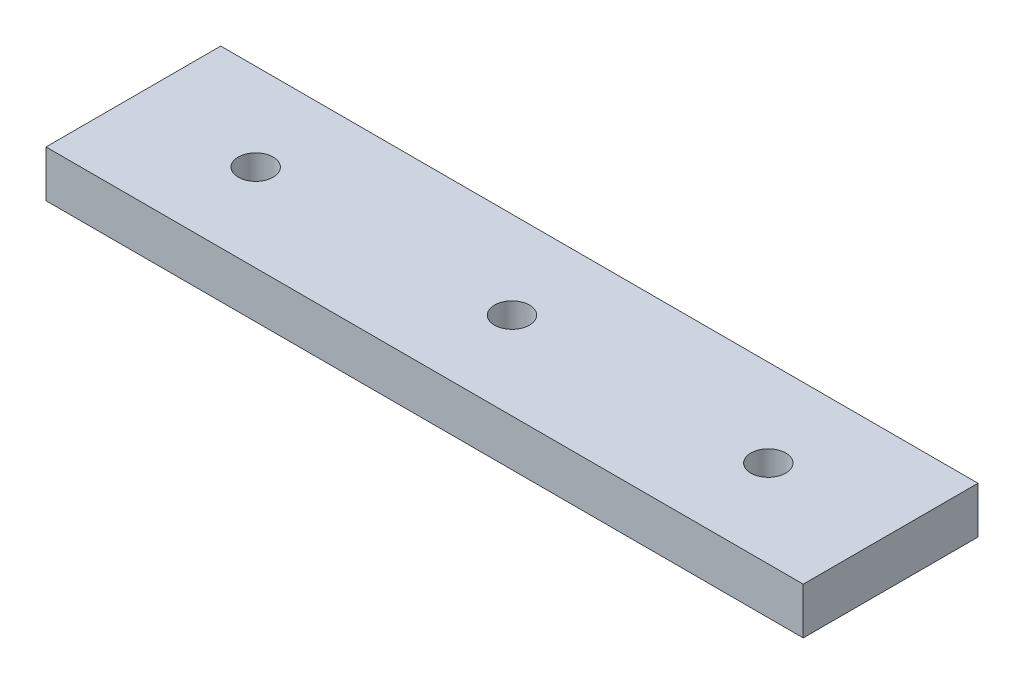
ISO-10303-21;
HEADER;
FILE_DESCRIPTION(('STEP AP214'),'2;1');
FILE_NAME('part.step','',(''),(''),'','','');
FILE_SCHEMA(('AUTOMOTIVE_DESIGN { 1 0 10303 214 1 1 1 1 }'));
ENDSEC;
DATA;
#1=APPLICATION_CONTEXT('core data for automotive mechanical design processes');
#2=APPLICATION_PROTOCOL_DEFINITION('international standard','automotive_design',2000,#1);
#3=PRODUCT_CONTEXT('',#1,'mechanical');
#4=PRODUCT('Part','Part','',(#3));
#5=PRODUCT_RELATED_PRODUCT_CATEGORY('part','',(#4));
#6=PRODUCT_DEFINITION_FORMATION('','',#4);
#7=PRODUCT_DEFINITION_CONTEXT('part definition',#1,'design');
#8=PRODUCT_DEFINITION('design','',#6,#7);
#9=PRODUCT_DEFINITION_SHAPE('','',#8);
#10=(LENGTH_UNIT() NAMED_UNIT(*) SI_UNIT(.MILLI.,.METRE.));
#11=(NAMED_UNIT(*) PLANE_ANGLE_UNIT() SI_UNIT($,.RADIAN.));
#12=(NAMED_UNIT(*) SI_UNIT($,.STERADIAN.) SOLID_ANGLE_UNIT());
#13=UNCERTAINTY_MEASURE_WITH_UNIT(LENGTH_MEASURE(1.E-05),#10,'distance_accuracy_value','');
#14=(GEOMETRIC_REPRESENTATION_CONTEXT(3) GLOBAL_UNCERTAINTY_ASSIGNED_CONTEXT((#13)) GLOBAL_UNIT_ASSIGNED_CONTEXT((#10,
#11,#12)) REPRESENTATION_CONTEXT('',''));
#15=CARTESIAN_POINT('',(0.,0.,0.));
#16=DIRECTION('',(0.,0.,1.));
#17=DIRECTION('',(1.,0.,0.));
#18=AXIS2_PLACEMENT_3D('',#15,#16,#17);
#19=CARTESIAN_POINT('',(32.5,4.,7.5));
#20=DIRECTION('',(-1.,0.,0.));
#21=DIRECTION('',(0.,0.,1.));
#22=AXIS2_PLACEMENT_3D('',#19,#20,#21);
#23=PLANE('',#22);
#24=DIRECTION('',(0.,0.,-1.));
#25=VECTOR('',#24,1.);
#26=CARTESIAN_POINT('',(32.5,0.,7.5));
#27=LINE('',#26,#25);
#28=CARTESIAN_POINT('',(32.5,0.,7.5));
#29=VERTEX_POINT('',#28);
#30=CARTESIAN_POINT('',(32.5,0.,-7.5));
#31=VERTEX_POINT('',#30);
#32=EDGE_CURVE('E95',#29,#31,#27,.T.);
#33=ORIENTED_EDGE('',*,*,#32,.T.);
#34=DIRECTION('',(0.,-1.,0.));
#35=VECTOR('',#34,1.);
#36=CARTESIAN_POINT('',(32.5,4.,-7.5));
#37=LINE('',#36,#35);
#38=CARTESIAN_POINT('',(32.5,4.,-7.5));
#39=VERTEX_POINT('',#38);
#40=EDGE_CURVE('E11',#39,#31,#37,.T.);
#41=ORIENTED_EDGE('',*,*,#40,.F.);
#42=DIRECTION('',(0.,0.,-1.));
#43=VECTOR('',#42,1.);
#44=CARTESIAN_POINT('',(32.5,4.,7.5));
#45=LINE('',#44,#43);
#46=CARTESIAN_POINT('',(32.5,4.,7.5));
#47=VERTEX_POINT('',#46);
#48=EDGE_CURVE('E83',#47,#39,#45,.T.);
#49=ORIENTED_EDGE('',*,*,#48,.F.);
#50=DIRECTION('',(0.,-1.,0.));
#51=VECTOR('',#50,1.);
#52=CARTESIAN_POINT('',(32.5,4.,7.5));
#53=LINE('',#52,#51);
#54=EDGE_CURVE('E91',#47,#29,#53,.T.);
#55=ORIENTED_EDGE('',*,*,#54,.T.);
#56=EDGE_LOOP('',(#33,#41,#49,#55));
#57=FACE_BOUND('',#56,.T.);
#58=ADVANCED_FACE('F32',(#57),#23,.F.);
#59=CARTESIAN_POINT('',(-32.5,4.,-7.5));
#60=DIRECTION('',(0.,0.,1.));
#61=DIRECTION('',(1.,0.,0.));
#62=AXIS2_PLACEMENT_3D('',#59,#60,#61);
#63=PLANE('',#62);
#64=DIRECTION('',(-1.,0.,0.));
#65=VECTOR('',#64,1.);
#66=CARTESIAN_POINT('',(-32.5,0.,-7.5));
#67=LINE('',#66,#65);
#68=CARTESIAN_POINT('',(-32.5,0.,-7.5));
#69=VERTEX_POINT('',#68);
#70=EDGE_CURVE('E87',#31,#69,#67,.T.);
#71=ORIENTED_EDGE('',*,*,#70,.T.);
#72=DIRECTION('',(0.,-1.,0.));
#73=VECTOR('',#72,1.);
#74=CARTESIAN_POINT('',(-32.5,4.,-7.5));
#75=LINE('',#74,#73);
#76=CARTESIAN_POINT('',(-32.5,4.,-7.5));
#77=VERTEX_POINT('',#76);
#78=EDGE_CURVE('E40',#77,#69,#75,.T.);
#79=ORIENTED_EDGE('',*,*,#78,.F.);
#80=DIRECTION('',(-1.,0.,0.));
#81=VECTOR('',#80,1.);
#82=CARTESIAN_POINT('',(-32.5,4.,-7.5));
#83=LINE('',#82,#81);
#84=EDGE_CURVE('E78',#39,#77,#83,.T.);
#85=ORIENTED_EDGE('',*,*,#84,.F.);
#86=ORIENTED_EDGE('',*,*,#40,.T.);
#87=EDGE_LOOP('',(#71,#79,#85,#86));
#88=FACE_BOUND('',#87,.T.);
#89=ADVANCED_FACE('F86',(#88),#63,.F.);
#90=CARTESIAN_POINT('',(-32.5,4.,7.5));
#91=DIRECTION('',(1.,0.,0.));
#92=DIRECTION('',(0.,0.,-1.));
#93=AXIS2_PLACEMENT_3D('',#90,#91,#92);
#94=PLANE('',#93);
#95=DIRECTION('',(0.,0.,1.));
#96=VECTOR('',#95,1.);
#97=CARTESIAN_POINT('',(-32.5,0.,7.5));
#98=LINE('',#97,#96);
#99=CARTESIAN_POINT('',(-32.5,0.,7.5));
#100=VERTEX_POINT('',#99);
#101=EDGE_CURVE('E65',#69,#100,#98,.T.);
#102=ORIENTED_EDGE('',*,*,#101,.T.);
#103=DIRECTION('',(0.,-1.,0.));
#104=VECTOR('',#103,1.);
#105=CARTESIAN_POINT('',(-32.5,4.,7.5));
#106=LINE('',#105,#104);
#107=CARTESIAN_POINT('',(-32.5,4.,7.5));
#108=VERTEX_POINT('',#107);
#109=EDGE_CURVE('E88',#108,#100,#106,.T.);
#110=ORIENTED_EDGE('',*,*,#109,.F.);
#111=DIRECTION('',(0.,0.,1.));
#112=VECTOR('',#111,1.);
#113=CARTESIAN_POINT('',(-32.5,4.,7.5));
#114=LINE('',#113,#112);
#115=EDGE_CURVE('E81',#77,#108,#114,.T.);
#116=ORIENTED_EDGE('',*,*,#115,.F.);
#117=ORIENTED_EDGE('',*,*,#78,.T.);
#118=EDGE_LOOP('',(#102,#110,#116,#117));
#119=FACE_BOUND('',#118,.T.);
#120=ADVANCED_FACE('F89',(#119),#94,.F.);
#121=CARTESIAN_POINT('',(-32.5,4.,7.5));
#122=DIRECTION('',(0.,0.,-1.));
#123=DIRECTION('',(-1.,0.,0.));
#124=AXIS2_PLACEMENT_3D('',#121,#122,#123);
#125=PLANE('',#124);
#126=DIRECTION('',(1.,0.,0.));
#127=VECTOR('',#126,1.);
#128=CARTESIAN_POINT('',(-32.5,0.,7.5));
#129=LINE('',#128,#127);
#130=EDGE_CURVE('E71',#100,#29,#129,.T.);
#131=ORIENTED_EDGE('',*,*,#130,.T.);
#132=ORIENTED_EDGE('',*,*,#54,.F.);
#133=DIRECTION('',(1.,0.,0.));
#134=VECTOR('',#133,1.);
#135=CARTESIAN_POINT('',(-32.5,4.,7.5));
#136=LINE('',#135,#134);
#137=EDGE_CURVE('E48',#108,#47,#136,.T.);
#138=ORIENTED_EDGE('',*,*,#137,.F.);
#139=ORIENTED_EDGE('',*,*,#109,.T.);
#140=EDGE_LOOP('',(#131,#132,#138,#139));
#141=FACE_BOUND('',#140,.T.);
#142=ADVANCED_FACE('F103',(#141),#125,.F.);
#143=CARTESIAN_POINT('',(0.,4.,0.));
#144=DIRECTION('',(0.,-1.,0.));
#145=DIRECTION('',(0.,0.,-1.));
#146=AXIS2_PLACEMENT_3D('',#143,#144,#145);
#147=PLANE('',#146);
#148=CARTESIAN_POINT('',(22.,4.,0.));
#149=DIRECTION('',(0.,1.,0.));
#150=DIRECTION('',(0.,0.,1.));
#151=AXIS2_PLACEMENT_3D('',#148,#149,#150);
#152=CIRCLE('',#151,1.50000000000002);
#153=CARTESIAN_POINT('',(22.,4.,1.50000000000002));
#154=VERTEX_POINT('',#153);
#155=EDGE_CURVE('E121',#154,#154,#152,.T.);
#156=ORIENTED_EDGE('',*,*,#155,.F.);
#157=EDGE_LOOP('',(#156));
#158=FACE_BOUND('',#157,.T.);
#159=CARTESIAN_POINT('',(0.,4.,0.));
#160=DIRECTION('',(0.,1.,0.));
#161=DIRECTION('',(0.,0.,1.));
#162=AXIS2_PLACEMENT_3D('',#159,#160,#161);
#163=CIRCLE('',#162,1.50000000000001);
#164=CARTESIAN_POINT('',(0.,4.,1.50000000000001));
#165=VERTEX_POINT('',#164);
#166=EDGE_CURVE('E115',#165,#165,#163,.T.);
#167=ORIENTED_EDGE('',*,*,#166,.F.);
#168=EDGE_LOOP('',(#167));
#169=FACE_BOUND('',#168,.T.);
#170=CARTESIAN_POINT('',(-22.,4.,0.));
#171=DIRECTION('',(0.,1.,0.));
#172=DIRECTION('',(0.,0.,1.));
#173=AXIS2_PLACEMENT_3D('',#170,#171,#172);
#174=CIRCLE('',#173,1.5);
#175=CARTESIAN_POINT('',(-22.,4.,1.5));
#176=VERTEX_POINT('',#175);
#177=EDGE_CURVE('E109',#176,#176,#174,.T.);
#178=ORIENTED_EDGE('',*,*,#177,.F.);
#179=EDGE_LOOP('',(#178));
#180=FACE_BOUND('',#179,.T.);
#181=ORIENTED_EDGE('',*,*,#48,.T.);
#182=ORIENTED_EDGE('',*,*,#84,.T.);
#183=ORIENTED_EDGE('',*,*,#115,.T.);
#184=ORIENTED_EDGE('',*,*,#137,.T.);
#185=EDGE_LOOP('',(#181,#182,#183,#184));
#186=FACE_BOUND('',#185,.T.);
#187=ADVANCED_FACE('F79',(#158,#169,#180,#186),#147,.F.);
#188=CARTESIAN_POINT('',(0.,0.,0.));
#189=DIRECTION('',(0.,-1.,0.));
#190=DIRECTION('',(0.,0.,-1.));
#191=AXIS2_PLACEMENT_3D('',#188,#189,#190);
#192=PLANE('',#191);
#193=CARTESIAN_POINT('',(22.,0.,0.));
#194=DIRECTION('',(0.,1.,0.));
#195=DIRECTION('',(0.,0.,1.));
#196=AXIS2_PLACEMENT_3D('',#193,#194,#195);
#197=CIRCLE('',#196,1.50000000000002);
#198=CARTESIAN_POINT('',(22.,0.,1.50000000000002));
#199=VERTEX_POINT('',#198);
#200=EDGE_CURVE('E118',#199,#199,#197,.T.);
#201=ORIENTED_EDGE('',*,*,#200,.T.);
#202=EDGE_LOOP('',(#201));
#203=FACE_BOUND('',#202,.T.);
#204=CARTESIAN_POINT('',(0.,0.,0.));
#205=DIRECTION('',(0.,1.,0.));
#206=DIRECTION('',(0.,0.,1.));
#207=AXIS2_PLACEMENT_3D('',#204,#205,#206);
#208=CIRCLE('',#207,1.50000000000001);
#209=CARTESIAN_POINT('',(0.,0.,1.50000000000001));
#210=VERTEX_POINT('',#209);
#211=EDGE_CURVE('E112',#210,#210,#208,.T.);
#212=ORIENTED_EDGE('',*,*,#211,.T.);
#213=EDGE_LOOP('',(#212));
#214=FACE_BOUND('',#213,.T.);
#215=CARTESIAN_POINT('',(-22.,0.,0.));
#216=DIRECTION('',(0.,1.,0.));
#217=DIRECTION('',(0.,0.,1.));
#218=AXIS2_PLACEMENT_3D('',#215,#216,#217);
#219=CIRCLE('',#218,1.5);
#220=CARTESIAN_POINT('',(-22.,0.,1.5));
#221=VERTEX_POINT('',#220);
#222=EDGE_CURVE('E98',#221,#221,#219,.T.);
#223=ORIENTED_EDGE('',*,*,#222,.T.);
#224=EDGE_LOOP('',(#223));
#225=FACE_BOUND('',#224,.T.);
#226=ORIENTED_EDGE('',*,*,#32,.F.);
#227=ORIENTED_EDGE('',*,*,#130,.F.);
#228=ORIENTED_EDGE('',*,*,#101,.F.);
#229=ORIENTED_EDGE('',*,*,#70,.F.);
#230=EDGE_LOOP('',(#226,#227,#228,#229));
#231=FACE_BOUND('',#230,.T.);
#232=ADVANCED_FACE('F106',(#203,#214,#225,#231),#192,.T.);
#233=CARTESIAN_POINT('',(-22.,0.,0.));
#234=DIRECTION('',(0.,1.,0.));
#235=DIRECTION('',(0.,0.,1.));
#236=AXIS2_PLACEMENT_3D('',#233,#234,#235);
#237=CYLINDRICAL_SURFACE('',#236,1.5);
#238=ORIENTED_EDGE('',*,*,#222,.F.);
#239=EDGE_LOOP('',(#238));
#240=FACE_BOUND('',#239,.T.);
#241=ORIENTED_EDGE('',*,*,#177,.T.);
#242=EDGE_LOOP('',(#241));
#243=FACE_BOUND('',#242,.T.);
#244=ADVANCED_FACE('F143',(#240,#243),#237,.F.);
#245=CARTESIAN_POINT('',(0.,0.,0.));
#246=DIRECTION('',(0.,1.,0.));
#247=DIRECTION('',(0.,0.,1.));
#248=AXIS2_PLACEMENT_3D('',#245,#246,#247);
#249=CYLINDRICAL_SURFACE('',#248,1.50000000000001);
#250=ORIENTED_EDGE('',*,*,#211,.F.);
#251=EDGE_LOOP('',(#250));
#252=FACE_BOUND('',#251,.T.);
#253=ORIENTED_EDGE('',*,*,#166,.T.);
#254=EDGE_LOOP('',(#253));
#255=FACE_BOUND('',#254,.T.);
#256=ADVANCED_FACE('F132',(#252,#255),#249,.F.);
#257=CARTESIAN_POINT('',(22.,0.,0.));
#258=DIRECTION('',(0.,1.,0.));
#259=DIRECTION('',(0.,0.,1.));
#260=AXIS2_PLACEMENT_3D('',#257,#258,#259);
#261=CYLINDRICAL_SURFACE('',#260,1.50000000000002);
#262=ORIENTED_EDGE('',*,*,#200,.F.);
#263=EDGE_LOOP('',(#262));
#264=FACE_BOUND('',#263,.T.);
#265=ORIENTED_EDGE('',*,*,#155,.T.);
#266=EDGE_LOOP('',(#265));
#267=FACE_BOUND('',#266,.T.);
#268=ADVANCED_FACE('F129',(#264,#267),#261,.F.);
#269=CLOSED_SHELL('',(#58,#89,#120,#142,#187,#232,#244,#256,#268));
#270=MANIFOLD_SOLID_BREP('B2',#269);
#271=ADVANCED_BREP_SHAPE_REPRESENTATION('',(#18,#270),#14);
#272=SHAPE_DEFINITION_REPRESENTATION(#9,#271);
ENDSEC;
END-ISO-10303-21;
